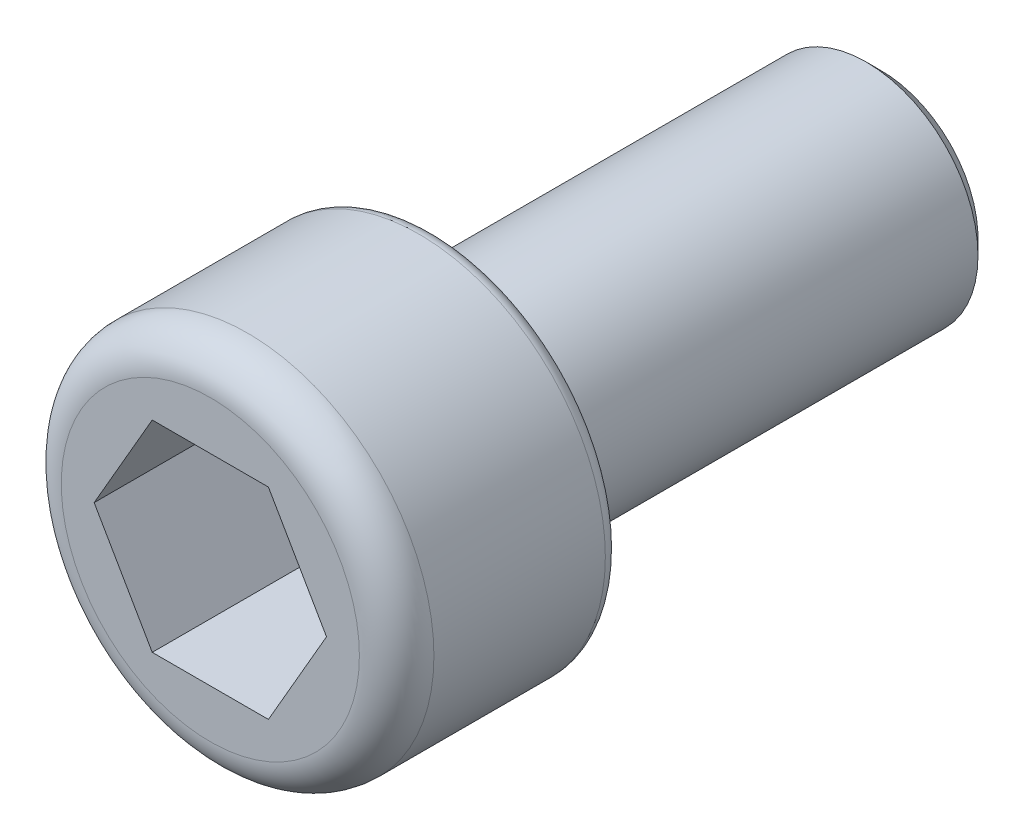
ISO-10303-21;
HEADER;
FILE_DESCRIPTION(('STEP AP214'),'2;1');
FILE_NAME('part.step','',(''),(''),'','','');
FILE_SCHEMA(('AUTOMOTIVE_DESIGN { 1 0 10303 214 1 1 1 1 }'));
ENDSEC;
DATA;
#1=APPLICATION_CONTEXT('core data for automotive mechanical design processes');
#2=APPLICATION_PROTOCOL_DEFINITION('international standard','automotive_design',2000,#1);
#3=PRODUCT_CONTEXT('',#1,'mechanical');
#4=PRODUCT('Part','Part','',(#3));
#5=PRODUCT_RELATED_PRODUCT_CATEGORY('part','',(#4));
#6=PRODUCT_DEFINITION_FORMATION('','',#4);
#7=PRODUCT_DEFINITION_CONTEXT('part definition',#1,'design');
#8=PRODUCT_DEFINITION('design','',#6,#7);
#9=PRODUCT_DEFINITION_SHAPE('','',#8);
#10=(LENGTH_UNIT() NAMED_UNIT(*) SI_UNIT(.MILLI.,.METRE.));
#11=(NAMED_UNIT(*) PLANE_ANGLE_UNIT() SI_UNIT($,.RADIAN.));
#12=(NAMED_UNIT(*) SI_UNIT($,.STERADIAN.) SOLID_ANGLE_UNIT());
#13=UNCERTAINTY_MEASURE_WITH_UNIT(LENGTH_MEASURE(1.E-05),#10,'distance_accuracy_value','');
#14=(GEOMETRIC_REPRESENTATION_CONTEXT(3) GLOBAL_UNCERTAINTY_ASSIGNED_CONTEXT((#13)) GLOBAL_UNIT_ASSIGNED_CONTEXT((#10,
#11,#12)) REPRESENTATION_CONTEXT('',''));
#15=CARTESIAN_POINT('',(0.,0.,0.));
#16=DIRECTION('',(0.,0.,1.));
#17=DIRECTION('',(1.,0.,0.));
#18=AXIS2_PLACEMENT_3D('',#15,#16,#17);
#19=CARTESIAN_POINT('',(0.,0.,0.));
#20=DIRECTION('',(0.,0.,1.));
#21=DIRECTION('',(1.,0.,0.));
#22=AXIS2_PLACEMENT_3D('',#19,#20,#21);
#23=PLANE('',#22);
#24=CARTESIAN_POINT('',(0.,0.,0.));
#25=DIRECTION('',(0.,0.,1.));
#26=DIRECTION('',(1.,0.,0.));
#27=AXIS2_PLACEMENT_3D('',#24,#25,#26);
#28=CIRCLE('',#27,2.3);
#29=CARTESIAN_POINT('',(2.3,0.,0.));
#30=VERTEX_POINT('',#29);
#31=EDGE_CURVE('E11',#30,#30,#28,.F.);
#32=ORIENTED_EDGE('',*,*,#31,.T.);
#33=EDGE_LOOP('',(#32));
#34=FACE_BOUND('',#33,.T.);
#35=CARTESIAN_POINT('',(0.,0.,0.));
#36=DIRECTION('',(0.,0.,1.));
#37=DIRECTION('',(1.,0.,0.));
#38=AXIS2_PLACEMENT_3D('',#35,#36,#37);
#39=CIRCLE('',#38,1.5);
#40=CARTESIAN_POINT('',(1.5,0.,0.));
#41=VERTEX_POINT('',#40);
#42=EDGE_CURVE('E148',#41,#41,#39,.F.);
#43=ORIENTED_EDGE('',*,*,#42,.F.);
#44=EDGE_LOOP('',(#43));
#45=FACE_BOUND('',#44,.T.);
#46=ADVANCED_FACE('F35',(#34,#45),#23,.F.);
#47=CARTESIAN_POINT('',(0.,0.,3.));
#48=DIRECTION('',(0.,0.,-1.));
#49=DIRECTION('',(-1.,0.,0.));
#50=AXIS2_PLACEMENT_3D('',#47,#48,#49);
#51=CYLINDRICAL_SURFACE('',#50,2.5);
#52=CARTESIAN_POINT('',(0.,0.,0.2));
#53=DIRECTION('',(0.,0.,1.));
#54=DIRECTION('',(1.,0.,0.));
#55=AXIS2_PLACEMENT_3D('',#52,#53,#54);
#56=CIRCLE('',#55,2.5);
#57=CARTESIAN_POINT('',(2.5,0.,0.2));
#58=VERTEX_POINT('',#57);
#59=EDGE_CURVE('E43',#58,#58,#56,.T.);
#60=ORIENTED_EDGE('',*,*,#59,.T.);
#61=EDGE_LOOP('',(#60));
#62=FACE_BOUND('',#61,.T.);
#63=CARTESIAN_POINT('',(0.,0.,2.5));
#64=DIRECTION('',(0.,0.,1.));
#65=DIRECTION('',(1.,0.,0.));
#66=AXIS2_PLACEMENT_3D('',#63,#64,#65);
#67=CIRCLE('',#66,2.5);
#68=CARTESIAN_POINT('',(2.5,0.,2.5));
#69=VERTEX_POINT('',#68);
#70=EDGE_CURVE('E145',#69,#69,#67,.F.);
#71=ORIENTED_EDGE('',*,*,#70,.T.);
#72=EDGE_LOOP('',(#71));
#73=FACE_BOUND('',#72,.T.);
#74=ADVANCED_FACE('F159',(#62,#73),#51,.T.);
#75=CARTESIAN_POINT('',(0.,0.,3.));
#76=DIRECTION('',(0.,0.,1.));
#77=DIRECTION('',(1.,0.,0.));
#78=AXIS2_PLACEMENT_3D('',#75,#76,#77);
#79=PLANE('',#78);
#80=DIRECTION('',(0.5,0.866025403784439,0.));
#81=VECTOR('',#80,1.);
#82=CARTESIAN_POINT('',(0.779422863405995,-1.35,3.));
#83=LINE('',#82,#81);
#84=CARTESIAN_POINT('',(0.779422863405995,-1.35,3.));
#85=VERTEX_POINT('',#84);
#86=CARTESIAN_POINT('',(1.55884572681199,0.,3.));
#87=VERTEX_POINT('',#86);
#88=EDGE_CURVE('E50',#85,#87,#83,.T.);
#89=ORIENTED_EDGE('',*,*,#88,.F.);
#90=DIRECTION('',(1.,0.,0.));
#91=VECTOR('',#90,1.);
#92=CARTESIAN_POINT('',(-0.779422863405994,-1.35,3.));
#93=LINE('',#92,#91);
#94=CARTESIAN_POINT('',(-0.779422863405994,-1.35,3.));
#95=VERTEX_POINT('',#94);
#96=EDGE_CURVE('E133',#95,#85,#93,.T.);
#97=ORIENTED_EDGE('',*,*,#96,.F.);
#98=DIRECTION('',(0.5,-0.866025403784438,0.));
#99=VECTOR('',#98,1.);
#100=CARTESIAN_POINT('',(-1.55884572681199,0.,3.));
#101=LINE('',#100,#99);
#102=CARTESIAN_POINT('',(-1.55884572681199,0.,3.));
#103=VERTEX_POINT('',#102);
#104=EDGE_CURVE('E131',#103,#95,#101,.T.);
#105=ORIENTED_EDGE('',*,*,#104,.F.);
#106=DIRECTION('',(-0.5,-0.866025403784438,0.));
#107=VECTOR('',#106,1.);
#108=CARTESIAN_POINT('',(-0.779422863405995,1.35,3.));
#109=LINE('',#108,#107);
#110=CARTESIAN_POINT('',(-0.779422863405995,1.35,3.));
#111=VERTEX_POINT('',#110);
#112=EDGE_CURVE('E98',#111,#103,#109,.T.);
#113=ORIENTED_EDGE('',*,*,#112,.F.);
#114=DIRECTION('',(-1.,0.,0.));
#115=VECTOR('',#114,1.);
#116=CARTESIAN_POINT('',(0.779422863405994,1.35,3.));
#117=LINE('',#116,#115);
#118=CARTESIAN_POINT('',(0.779422863405994,1.35,3.));
#119=VERTEX_POINT('',#118);
#120=EDGE_CURVE('E127',#119,#111,#117,.T.);
#121=ORIENTED_EDGE('',*,*,#120,.F.);
#122=DIRECTION('',(-0.5,0.866025403784438,0.));
#123=VECTOR('',#122,1.);
#124=CARTESIAN_POINT('',(1.55884572681199,0.,3.));
#125=LINE('',#124,#123);
#126=EDGE_CURVE('E124',#87,#119,#125,.T.);
#127=ORIENTED_EDGE('',*,*,#126,.F.);
#128=EDGE_LOOP('',(#89,#97,#105,#113,#121,#127));
#129=FACE_BOUND('',#128,.T.);
#130=CARTESIAN_POINT('',(0.,0.,3.));
#131=DIRECTION('',(0.,0.,1.));
#132=DIRECTION('',(1.,0.,0.));
#133=AXIS2_PLACEMENT_3D('',#130,#131,#132);
#134=CIRCLE('',#133,2.);
#135=CARTESIAN_POINT('',(2.,0.,3.));
#136=VERTEX_POINT('',#135);
#137=EDGE_CURVE('E137',#136,#136,#134,.T.);
#138=ORIENTED_EDGE('',*,*,#137,.T.);
#139=EDGE_LOOP('',(#138));
#140=FACE_BOUND('',#139,.T.);
#141=ADVANCED_FACE('F177',(#129,#140),#79,.T.);
#142=CARTESIAN_POINT('',(0.,0.,2.5));
#143=DIRECTION('',(0.,0.,1.));
#144=DIRECTION('',(1.,0.,0.));
#145=AXIS2_PLACEMENT_3D('',#142,#143,#144);
#146=TOROIDAL_SURFACE('',#145,2.,0.5);
#147=ORIENTED_EDGE('',*,*,#70,.F.);
#148=EDGE_LOOP('',(#147));
#149=FACE_BOUND('',#148,.T.);
#150=ORIENTED_EDGE('',*,*,#137,.F.);
#151=EDGE_LOOP('',(#150));
#152=FACE_BOUND('',#151,.T.);
#153=ADVANCED_FACE('F183',(#149,#152),#146,.T.);
#154=CARTESIAN_POINT('',(0.779422863405995,-1.35,1.));
#155=DIRECTION('',(0.866025403784439,-0.5,0.));
#156=DIRECTION('',(0.5,0.866025403784439,0.));
#157=AXIS2_PLACEMENT_3D('',#154,#155,#156);
#158=PLANE('',#157);
#159=ORIENTED_EDGE('',*,*,#88,.T.);
#160=DIRECTION('',(0.,0.,1.));
#161=VECTOR('',#160,1.);
#162=CARTESIAN_POINT('',(1.55884572681199,0.,1.));
#163=LINE('',#162,#161);
#164=CARTESIAN_POINT('',(1.55884572681199,0.,1.));
#165=VERTEX_POINT('',#164);
#166=EDGE_CURVE('E80',#165,#87,#163,.T.);
#167=ORIENTED_EDGE('',*,*,#166,.F.);
#168=DIRECTION('',(0.5,0.866025403784439,0.));
#169=VECTOR('',#168,1.);
#170=CARTESIAN_POINT('',(0.779422863405995,-1.35,1.));
#171=LINE('',#170,#169);
#172=CARTESIAN_POINT('',(0.779422863405995,-1.35,1.));
#173=VERTEX_POINT('',#172);
#174=EDGE_CURVE('E135',#173,#165,#171,.T.);
#175=ORIENTED_EDGE('',*,*,#174,.F.);
#176=DIRECTION('',(0.,0.,1.));
#177=VECTOR('',#176,1.);
#178=CARTESIAN_POINT('',(0.779422863405995,-1.35,1.));
#179=LINE('',#178,#177);
#180=EDGE_CURVE('E58',#173,#85,#179,.T.);
#181=ORIENTED_EDGE('',*,*,#180,.T.);
#182=EDGE_LOOP('',(#159,#167,#175,#181));
#183=FACE_BOUND('',#182,.T.);
#184=ADVANCED_FACE('F185',(#183),#158,.F.);
#185=CARTESIAN_POINT('',(-0.779422863405994,-1.35,1.));
#186=DIRECTION('',(0.,-1.,0.));
#187=DIRECTION('',(0.,0.,-1.));
#188=AXIS2_PLACEMENT_3D('',#185,#186,#187);
#189=PLANE('',#188);
#190=ORIENTED_EDGE('',*,*,#96,.T.);
#191=ORIENTED_EDGE('',*,*,#180,.F.);
#192=DIRECTION('',(1.,0.,0.));
#193=VECTOR('',#192,1.);
#194=CARTESIAN_POINT('',(-0.779422863405994,-1.35,1.));
#195=LINE('',#194,#193);
#196=CARTESIAN_POINT('',(-0.779422863405994,-1.35,1.));
#197=VERTEX_POINT('',#196);
#198=EDGE_CURVE('E110',#197,#173,#195,.T.);
#199=ORIENTED_EDGE('',*,*,#198,.F.);
#200=DIRECTION('',(0.,0.,1.));
#201=VECTOR('',#200,1.);
#202=CARTESIAN_POINT('',(-0.779422863405994,-1.35,1.));
#203=LINE('',#202,#201);
#204=EDGE_CURVE('E102',#197,#95,#203,.T.);
#205=ORIENTED_EDGE('',*,*,#204,.T.);
#206=EDGE_LOOP('',(#190,#191,#199,#205));
#207=FACE_BOUND('',#206,.T.);
#208=ADVANCED_FACE('F191',(#207),#189,.F.);
#209=CARTESIAN_POINT('',(-1.55884572681199,0.,1.));
#210=DIRECTION('',(-0.866025403784438,-0.5,0.));
#211=DIRECTION('',(0.5,-0.866025403784438,0.));
#212=AXIS2_PLACEMENT_3D('',#209,#210,#211);
#213=PLANE('',#212);
#214=ORIENTED_EDGE('',*,*,#104,.T.);
#215=ORIENTED_EDGE('',*,*,#204,.F.);
#216=DIRECTION('',(0.5,-0.866025403784438,0.));
#217=VECTOR('',#216,1.);
#218=CARTESIAN_POINT('',(-1.55884572681199,0.,1.));
#219=LINE('',#218,#217);
#220=CARTESIAN_POINT('',(-1.55884572681199,0.,1.));
#221=VERTEX_POINT('',#220);
#222=EDGE_CURVE('E106',#221,#197,#219,.T.);
#223=ORIENTED_EDGE('',*,*,#222,.F.);
#224=DIRECTION('',(0.,0.,1.));
#225=VECTOR('',#224,1.);
#226=CARTESIAN_POINT('',(-1.55884572681199,0.,1.));
#227=LINE('',#226,#225);
#228=EDGE_CURVE('E91',#221,#103,#227,.T.);
#229=ORIENTED_EDGE('',*,*,#228,.T.);
#230=EDGE_LOOP('',(#214,#215,#223,#229));
#231=FACE_BOUND('',#230,.T.);
#232=ADVANCED_FACE('F107',(#231),#213,.F.);
#233=CARTESIAN_POINT('',(-0.779422863405995,1.35,1.));
#234=DIRECTION('',(-0.866025403784439,0.5,0.));
#235=DIRECTION('',(-0.5,-0.866025403784439,0.));
#236=AXIS2_PLACEMENT_3D('',#233,#234,#235);
#237=PLANE('',#236);
#238=ORIENTED_EDGE('',*,*,#112,.T.);
#239=ORIENTED_EDGE('',*,*,#228,.F.);
#240=DIRECTION('',(-0.5,-0.866025403784438,0.));
#241=VECTOR('',#240,1.);
#242=CARTESIAN_POINT('',(-0.779422863405995,1.35,1.));
#243=LINE('',#242,#241);
#244=CARTESIAN_POINT('',(-0.779422863405995,1.35,1.));
#245=VERTEX_POINT('',#244);
#246=EDGE_CURVE('E95',#245,#221,#243,.T.);
#247=ORIENTED_EDGE('',*,*,#246,.F.);
#248=DIRECTION('',(0.,0.,1.));
#249=VECTOR('',#248,1.);
#250=CARTESIAN_POINT('',(-0.779422863405995,1.35,1.));
#251=LINE('',#250,#249);
#252=EDGE_CURVE('E103',#245,#111,#251,.T.);
#253=ORIENTED_EDGE('',*,*,#252,.T.);
#254=EDGE_LOOP('',(#238,#239,#247,#253));
#255=FACE_BOUND('',#254,.T.);
#256=ADVANCED_FACE('F93',(#255),#237,.F.);
#257=CARTESIAN_POINT('',(0.779422863405994,1.35,1.));
#258=DIRECTION('',(0.,1.,0.));
#259=DIRECTION('',(0.,0.,1.));
#260=AXIS2_PLACEMENT_3D('',#257,#258,#259);
#261=PLANE('',#260);
#262=ORIENTED_EDGE('',*,*,#120,.T.);
#263=ORIENTED_EDGE('',*,*,#252,.F.);
#264=DIRECTION('',(-1.,0.,0.));
#265=VECTOR('',#264,1.);
#266=CARTESIAN_POINT('',(0.779422863405994,1.35,1.));
#267=LINE('',#266,#265);
#268=CARTESIAN_POINT('',(0.779422863405994,1.35,1.));
#269=VERTEX_POINT('',#268);
#270=EDGE_CURVE('E116',#269,#245,#267,.T.);
#271=ORIENTED_EDGE('',*,*,#270,.F.);
#272=DIRECTION('',(0.,0.,1.));
#273=VECTOR('',#272,1.);
#274=CARTESIAN_POINT('',(0.779422863405994,1.35,1.));
#275=LINE('',#274,#273);
#276=EDGE_CURVE('E140',#269,#119,#275,.T.);
#277=ORIENTED_EDGE('',*,*,#276,.T.);
#278=EDGE_LOOP('',(#262,#263,#271,#277));
#279=FACE_BOUND('',#278,.T.);
#280=ADVANCED_FACE('F216',(#279),#261,.F.);
#281=CARTESIAN_POINT('',(1.55884572681199,0.,1.));
#282=DIRECTION('',(0.866025403784438,0.5,0.));
#283=DIRECTION('',(-0.5,0.866025403784438,0.));
#284=AXIS2_PLACEMENT_3D('',#281,#282,#283);
#285=PLANE('',#284);
#286=ORIENTED_EDGE('',*,*,#126,.T.);
#287=ORIENTED_EDGE('',*,*,#276,.F.);
#288=DIRECTION('',(-0.5,0.866025403784438,0.));
#289=VECTOR('',#288,1.);
#290=CARTESIAN_POINT('',(1.55884572681199,0.,1.));
#291=LINE('',#290,#289);
#292=EDGE_CURVE('E118',#165,#269,#291,.T.);
#293=ORIENTED_EDGE('',*,*,#292,.F.);
#294=ORIENTED_EDGE('',*,*,#166,.T.);
#295=EDGE_LOOP('',(#286,#287,#293,#294));
#296=FACE_BOUND('',#295,.T.);
#297=ADVANCED_FACE('F203',(#296),#285,.F.);
#298=CARTESIAN_POINT('',(0.,0.,1.));
#299=DIRECTION('',(0.,0.,1.));
#300=DIRECTION('',(1.,0.,0.));
#301=AXIS2_PLACEMENT_3D('',#298,#299,#300);
#302=PLANE('',#301);
#303=ORIENTED_EDGE('',*,*,#174,.T.);
#304=ORIENTED_EDGE('',*,*,#292,.T.);
#305=ORIENTED_EDGE('',*,*,#270,.T.);
#306=ORIENTED_EDGE('',*,*,#246,.T.);
#307=ORIENTED_EDGE('',*,*,#222,.T.);
#308=ORIENTED_EDGE('',*,*,#198,.T.);
#309=EDGE_LOOP('',(#303,#304,#305,#306,#307,#308));
#310=FACE_BOUND('',#309,.T.);
#311=ADVANCED_FACE('F113',(#310),#302,.T.);
#312=CARTESIAN_POINT('',(0.,0.,-6.));
#313=DIRECTION('',(0.,0.,1.));
#314=DIRECTION('',(1.,0.,0.));
#315=AXIS2_PLACEMENT_3D('',#312,#313,#314);
#316=CYLINDRICAL_SURFACE('',#315,1.5);
#317=CARTESIAN_POINT('',(0.,0.,-5.8));
#318=DIRECTION('',(0.,0.,-1.));
#319=DIRECTION('',(-1.,0.,0.));
#320=AXIS2_PLACEMENT_3D('',#317,#318,#319);
#321=CIRCLE('',#320,1.5);
#322=CARTESIAN_POINT('',(-1.5,0.,-5.8));
#323=VERTEX_POINT('',#322);
#324=EDGE_CURVE('E154',#323,#323,#321,.F.);
#325=ORIENTED_EDGE('',*,*,#324,.T.);
#326=EDGE_LOOP('',(#325));
#327=FACE_BOUND('',#326,.T.);
#328=ORIENTED_EDGE('',*,*,#42,.T.);
#329=EDGE_LOOP('',(#328));
#330=FACE_BOUND('',#329,.T.);
#331=ADVANCED_FACE('F224',(#327,#330),#316,.T.);
#332=CARTESIAN_POINT('',(0.,0.,-6.));
#333=DIRECTION('',(0.,0.,-1.));
#334=DIRECTION('',(-1.,0.,0.));
#335=AXIS2_PLACEMENT_3D('',#332,#333,#334);
#336=PLANE('',#335);
#337=CARTESIAN_POINT('',(0.,0.,-6.));
#338=DIRECTION('',(0.,0.,-1.));
#339=DIRECTION('',(-1.,0.,0.));
#340=AXIS2_PLACEMENT_3D('',#337,#338,#339);
#341=CIRCLE('',#340,1.3);
#342=CARTESIAN_POINT('',(-1.3,0.,-6.));
#343=VERTEX_POINT('',#342);
#344=EDGE_CURVE('E151',#343,#343,#341,.T.);
#345=ORIENTED_EDGE('',*,*,#344,.T.);
#346=EDGE_LOOP('',(#345));
#347=FACE_BOUND('',#346,.T.);
#348=ADVANCED_FACE('F168',(#347),#336,.T.);
#349=CARTESIAN_POINT('',(0.,0.,-6.));
#350=DIRECTION('',(0.,0.,1.));
#351=DIRECTION('',(1.,0.,0.));
#352=AXIS2_PLACEMENT_3D('',#349,#350,#351);
#353=CONICAL_SURFACE('',#352,1.3,0.78539816339745);
#354=ORIENTED_EDGE('',*,*,#324,.F.);
#355=EDGE_LOOP('',(#354));
#356=FACE_BOUND('',#355,.T.);
#357=ORIENTED_EDGE('',*,*,#344,.F.);
#358=EDGE_LOOP('',(#357));
#359=FACE_BOUND('',#358,.T.);
#360=ADVANCED_FACE('F163',(#356,#359),#353,.T.);
#361=CARTESIAN_POINT('',(0.,0.,0.2));
#362=DIRECTION('',(0.,0.,1.));
#363=DIRECTION('',(1.,0.,0.));
#364=AXIS2_PLACEMENT_3D('',#361,#362,#363);
#365=TOROIDAL_SURFACE('',#364,2.3,0.2);
#366=ORIENTED_EDGE('',*,*,#31,.F.);
#367=EDGE_LOOP('',(#366));
#368=FACE_BOUND('',#367,.T.);
#369=ORIENTED_EDGE('',*,*,#59,.F.);
#370=EDGE_LOOP('',(#369));
#371=FACE_BOUND('',#370,.T.);
#372=ADVANCED_FACE('F37',(#368,#371),#365,.T.);
#373=CLOSED_SHELL('',(#46,#74,#141,#153,#184,#208,#232,#256,#280,#297,#311,#331,#348,#360,#372));
#374=MANIFOLD_SOLID_BREP('B2',#373);
#375=ADVANCED_BREP_SHAPE_REPRESENTATION('',(#18,#374),#14);
#376=SHAPE_DEFINITION_REPRESENTATION(#9,#375);
ENDSEC;
END-ISO-10303-21;
